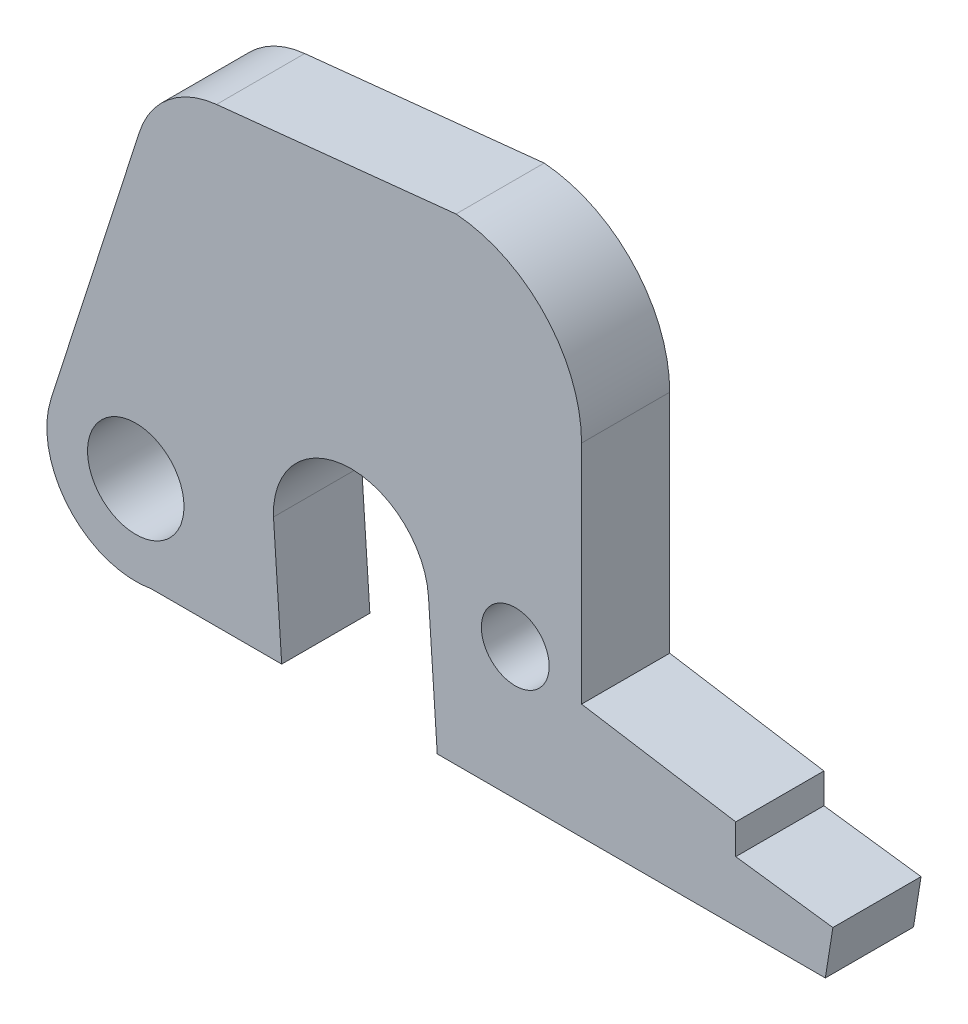
ISO-10303-21;
HEADER;
FILE_DESCRIPTION(('STEP AP214'),'2;1');
FILE_NAME('part.step','',(''),(''),'','','');
FILE_SCHEMA(('AUTOMOTIVE_DESIGN { 1 0 10303 214 1 1 1 1 }'));
ENDSEC;
DATA;
#1=APPLICATION_CONTEXT('core data for automotive mechanical design processes');
#2=APPLICATION_PROTOCOL_DEFINITION('international standard','automotive_design',2000,#1);
#3=PRODUCT_CONTEXT('',#1,'mechanical');
#4=PRODUCT('Part','Part','',(#3));
#5=PRODUCT_RELATED_PRODUCT_CATEGORY('part','',(#4));
#6=PRODUCT_DEFINITION_FORMATION('','',#4);
#7=PRODUCT_DEFINITION_CONTEXT('part definition',#1,'design');
#8=PRODUCT_DEFINITION('design','',#6,#7);
#9=PRODUCT_DEFINITION_SHAPE('','',#8);
#10=(LENGTH_UNIT() NAMED_UNIT(*) SI_UNIT(.MILLI.,.METRE.));
#11=(NAMED_UNIT(*) PLANE_ANGLE_UNIT() SI_UNIT($,.RADIAN.));
#12=(NAMED_UNIT(*) SI_UNIT($,.STERADIAN.) SOLID_ANGLE_UNIT());
#13=UNCERTAINTY_MEASURE_WITH_UNIT(LENGTH_MEASURE(1.E-05),#10,'distance_accuracy_value','');
#14=(GEOMETRIC_REPRESENTATION_CONTEXT(3) GLOBAL_UNCERTAINTY_ASSIGNED_CONTEXT((#13)) GLOBAL_UNIT_ASSIGNED_CONTEXT((#10,
#11,#12)) REPRESENTATION_CONTEXT('',''));
#15=CARTESIAN_POINT('',(0.,0.,0.));
#16=DIRECTION('',(0.,0.,1.));
#17=DIRECTION('',(1.,0.,0.));
#18=AXIS2_PLACEMENT_3D('',#15,#16,#17);
#19=CARTESIAN_POINT('',(-1.23620593143182,-5.65941247394212,1.4859));
#20=DIRECTION('',(0.,0.,1.));
#21=DIRECTION('',(1.,0.,0.));
#22=AXIS2_PLACEMENT_3D('',#19,#20,#21);
#23=PLANE('',#22);
#24=CARTESIAN_POINT('',(-8.49301630274746,-6.96993359020735,1.4859));
#25=DIRECTION('',(0.,0.,1.));
#26=DIRECTION('',(1.,0.,0.));
#27=AXIS2_PLACEMENT_3D('',#24,#25,#26);
#28=CIRCLE('',#27,1.6256);
#29=CARTESIAN_POINT('',(-6.86741630274746,-6.96993359020735,1.4859));
#30=VERTEX_POINT('',#29);
#31=EDGE_CURVE('E173',#30,#30,#28,.T.);
#32=ORIENTED_EDGE('',*,*,#31,.F.);
#33=EDGE_LOOP('',(#32));
#34=FACE_BOUND('',#33,.T.);
#35=DIRECTION('',(0.0664515565522178,-0.997789652497854,0.));
#36=VECTOR('',#35,1.);
#37=CARTESIAN_POINT('',(1.66958852630767,-9.92073691704316,1.4859));
#38=LINE('',#37,#36);
#39=CARTESIAN_POINT('',(1.37421135743306,-5.48556191169021,1.4859));
#40=VERTEX_POINT('',#39);
#41=CARTESIAN_POINT('',(1.66958852630767,-9.92073691704316,1.4859));
#42=VERTEX_POINT('',#41);
#43=EDGE_CURVE('E198',#40,#42,#38,.T.);
#44=ORIENTED_EDGE('',*,*,#43,.T.);
#45=DIRECTION('',(1.,0.,0.));
#46=VECTOR('',#45,1.);
#47=CARTESIAN_POINT('',(1.66958852630767,-9.92073691704316,1.4859));
#48=LINE('',#47,#46);
#49=CARTESIAN_POINT('',(14.7505885263077,-9.92073691704316,1.4859));
#50=VERTEX_POINT('',#49);
#51=EDGE_CURVE('E111',#42,#50,#48,.T.);
#52=ORIENTED_EDGE('',*,*,#51,.T.);
#53=DIRECTION('',(0.156767544200709,0.987635528464463,0.));
#54=VECTOR('',#53,1.);
#55=CARTESIAN_POINT('',(14.7505885263077,-9.92073691704316,1.4859));
#56=LINE('',#55,#54);
#57=CARTESIAN_POINT('',(15.0045885263077,-8.32053691704316,1.4859));
#58=VERTEX_POINT('',#57);
#59=EDGE_CURVE('E234',#50,#58,#56,.T.);
#60=ORIENTED_EDGE('',*,*,#59,.T.);
#61=DIRECTION('',(-0.99141388324305,0.130761279104084,0.));
#62=VECTOR('',#61,1.);
#63=CARTESIAN_POINT('',(15.0045885263077,-8.32053691704316,1.4859));
#64=LINE('',#63,#62);
#65=CARTESIAN_POINT('',(11.7307408114685,-7.88873691704316,1.4859));
#66=VERTEX_POINT('',#65);
#67=EDGE_CURVE('E253',#58,#66,#64,.T.);
#68=ORIENTED_EDGE('',*,*,#67,.T.);
#69=DIRECTION('',(0.,1.,0.));
#70=VECTOR('',#69,1.);
#71=CARTESIAN_POINT('',(11.7307408114685,-7.88873691704316,1.4859));
#72=LINE('',#71,#70);
#73=CARTESIAN_POINT('',(11.7307408114685,-6.87273691704316,1.4859));
#74=VERTEX_POINT('',#73);
#75=EDGE_CURVE('E250',#66,#74,#72,.T.);
#76=ORIENTED_EDGE('',*,*,#75,.T.);
#77=DIRECTION('',(-0.987241089858923,0.159232630117595,0.));
#78=VECTOR('',#77,1.);
#79=CARTESIAN_POINT('',(11.7307408114685,-6.87273691704316,1.4859));
#80=LINE('',#79,#78);
#81=CARTESIAN_POINT('',(6.53390721706875,-6.03453691704316,1.4859));
#82=VERTEX_POINT('',#81);
#83=EDGE_CURVE('E252',#74,#82,#80,.T.);
#84=ORIENTED_EDGE('',*,*,#83,.T.);
#85=DIRECTION('',(0.,1.,0.));
#86=VECTOR('',#85,1.);
#87=CARTESIAN_POINT('',(6.53390721706875,-6.03453691704316,1.4859));
#88=LINE('',#87,#86);
#89=CARTESIAN_POINT('',(6.53390721706875,1.58546308295684,1.4859));
#90=VERTEX_POINT('',#89);
#91=EDGE_CURVE('E255',#82,#90,#88,.T.);
#92=ORIENTED_EDGE('',*,*,#91,.T.);
#93=CARTESIAN_POINT('',(1.94827208508378,1.58546308295684,1.4859));
#94=DIRECTION('',(0.,0.,1.));
#95=DIRECTION('',(1.,0.,0.));
#96=AXIS2_PLACEMENT_3D('',#93,#94,#95);
#97=CIRCLE('',#96,4.58563513198498);
#98=CARTESIAN_POINT('',(2.30163530288507,6.15746308295684,1.4859));
#99=VERTEX_POINT('',#98);
#100=EDGE_CURVE('E261',#90,#99,#97,.T.);
#101=ORIENTED_EDGE('',*,*,#100,.T.);
#102=DIRECTION('',(-0.994652091225226,-0.103282222193776,0.));
#103=VECTOR('',#102,1.);
#104=CARTESIAN_POINT('',(2.30163530288507,6.15746308295684,1.4859));
#105=LINE('',#104,#103);
#106=CARTESIAN_POINT('',(-5.77059015040525,5.31926308295683,1.4859));
#107=VERTEX_POINT('',#106);
#108=EDGE_CURVE('E263',#99,#107,#105,.T.);
#109=ORIENTED_EDGE('',*,*,#108,.T.);
#110=CARTESIAN_POINT('',(-5.45413095411571,2.27162531247704,1.4859));
#111=DIRECTION('',(0.,0.,1.));
#112=DIRECTION('',(1.,0.,0.));
#113=AXIS2_PLACEMENT_3D('',#110,#111,#112);
#114=CIRCLE('',#113,3.06402389073115);
#115=CARTESIAN_POINT('',(-8.37133495275812,3.20872895310384,1.4859));
#116=VERTEX_POINT('',#115);
#117=EDGE_CURVE('E265',#107,#116,#114,.T.);
#118=ORIENTED_EDGE('',*,*,#117,.T.);
#119=DIRECTION('',(-0.305840840034436,-0.952082654272743,0.));
#120=VECTOR('',#119,1.);
#121=CARTESIAN_POINT('',(-8.37133495275813,3.20872895310384,1.4859));
#122=LINE('',#121,#120);
#123=CARTESIAN_POINT('',(-11.3465984341337,-6.05326742445613,1.4859));
#124=VERTEX_POINT('',#123);
#125=EDGE_CURVE('E267',#116,#124,#122,.T.);
#126=ORIENTED_EDGE('',*,*,#125,.T.);
#127=CARTESIAN_POINT('',(-8.49301630274746,-6.96993359020735,1.4859));
#128=DIRECTION('',(0.,0.,1.));
#129=DIRECTION('',(1.,0.,0.));
#130=AXIS2_PLACEMENT_3D('',#127,#128,#129);
#131=CIRCLE('',#130,2.9972);
#132=CARTESIAN_POINT('',(-7.96769015040525,-9.92073691704316,1.4859));
#133=VERTEX_POINT('',#132);
#134=EDGE_CURVE('E151',#124,#133,#131,.T.);
#135=ORIENTED_EDGE('',*,*,#134,.T.);
#136=DIRECTION('',(1.,0.,0.));
#137=VECTOR('',#136,1.);
#138=CARTESIAN_POINT('',(-7.96769015040524,-9.92073691704316,1.4859));
#139=LINE('',#138,#137);
#140=CARTESIAN_POINT('',(-3.57349015040525,-9.92073691704316,1.4859));
#141=VERTEX_POINT('',#140);
#142=EDGE_CURVE('E145',#133,#141,#139,.T.);
#143=ORIENTED_EDGE('',*,*,#142,.T.);
#144=DIRECTION('',(-0.0664515565522176,0.997789652497854,0.));
#145=VECTOR('',#144,1.);
#146=CARTESIAN_POINT('',(-3.85030075437916,-5.7643443405981,1.4859));
#147=LINE('',#146,#145);
#148=CARTESIAN_POINT('',(-3.85030075437916,-5.7643443405981,1.4859));
#149=VERTEX_POINT('',#148);
#150=EDGE_CURVE('E149',#141,#149,#147,.T.);
#151=ORIENTED_EDGE('',*,*,#150,.T.);
#152=CARTESIAN_POINT('',(-1.23620593143182,-5.65941247394212,1.4859));
#153=DIRECTION('',(0.,0.,-1.));
#154=DIRECTION('',(1.,0.,0.));
#155=AXIS2_PLACEMENT_3D('',#152,#153,#154);
#156=CIRCLE('',#155,2.6162);
#157=EDGE_CURVE('E47',#149,#40,#156,.T.);
#158=ORIENTED_EDGE('',*,*,#157,.T.);
#159=EDGE_LOOP('',(#44,#52,#60,#68,#76,#84,#92,#101,#109,#118,#126,#135,#143,#151,#158));
#160=FACE_BOUND('',#159,.T.);
#161=CARTESIAN_POINT('',(4.29870721706875,-5.47573691704316,1.4859));
#162=DIRECTION('',(0.,0.,1.));
#163=DIRECTION('',(1.,0.,0.));
#164=AXIS2_PLACEMENT_3D('',#161,#162,#163);
#165=CIRCLE('',#164,1.143);
#166=CARTESIAN_POINT('',(5.44170721706875,-5.47573691704316,1.4859));
#167=VERTEX_POINT('',#166);
#168=EDGE_CURVE('E310',#167,#167,#165,.T.);
#169=ORIENTED_EDGE('',*,*,#168,.F.);
#170=EDGE_LOOP('',(#169));
#171=FACE_BOUND('',#170,.T.);
#172=ADVANCED_FACE('F30',(#34,#160,#171),#23,.T.);
#173=CARTESIAN_POINT('',(-1.23620593143182,-5.65941247394212,-1.4859));
#174=DIRECTION('',(0.,0.,1.));
#175=DIRECTION('',(1.,0.,0.));
#176=AXIS2_PLACEMENT_3D('',#173,#174,#175);
#177=PLANE('',#176);
#178=CARTESIAN_POINT('',(-8.49301630274746,-6.96993359020735,-1.4859));
#179=DIRECTION('',(0.,0.,1.));
#180=DIRECTION('',(1.,0.,0.));
#181=AXIS2_PLACEMENT_3D('',#178,#179,#180);
#182=CIRCLE('',#181,1.6256);
#183=CARTESIAN_POINT('',(-6.86741630274746,-6.96993359020735,-1.4859));
#184=VERTEX_POINT('',#183);
#185=EDGE_CURVE('E315',#184,#184,#182,.T.);
#186=ORIENTED_EDGE('',*,*,#185,.T.);
#187=EDGE_LOOP('',(#186));
#188=FACE_BOUND('',#187,.T.);
#189=DIRECTION('',(0.0664515565522178,-0.997789652497854,0.));
#190=VECTOR('',#189,1.);
#191=CARTESIAN_POINT('',(1.66958852630767,-9.92073691704316,-1.4859));
#192=LINE('',#191,#190);
#193=CARTESIAN_POINT('',(1.37421135743306,-5.48556191169021,-1.4859));
#194=VERTEX_POINT('',#193);
#195=CARTESIAN_POINT('',(1.66958852630767,-9.92073691704316,-1.4859));
#196=VERTEX_POINT('',#195);
#197=EDGE_CURVE('E169',#194,#196,#192,.T.);
#198=ORIENTED_EDGE('',*,*,#197,.F.);
#199=CARTESIAN_POINT('',(-1.23620593143182,-5.65941247394212,-1.4859));
#200=DIRECTION('',(0.,0.,-1.));
#201=DIRECTION('',(1.,0.,0.));
#202=AXIS2_PLACEMENT_3D('',#199,#200,#201);
#203=CIRCLE('',#202,2.6162);
#204=CARTESIAN_POINT('',(-3.85030075437916,-5.7643443405981,-1.4859));
#205=VERTEX_POINT('',#204);
#206=EDGE_CURVE('E103',#205,#194,#203,.T.);
#207=ORIENTED_EDGE('',*,*,#206,.F.);
#208=DIRECTION('',(-0.0664515565522176,0.997789652497854,0.));
#209=VECTOR('',#208,1.);
#210=CARTESIAN_POINT('',(-3.85030075437916,-5.7643443405981,-1.4859));
#211=LINE('',#210,#209);
#212=CARTESIAN_POINT('',(-3.57349015040525,-9.92073691704316,-1.4859));
#213=VERTEX_POINT('',#212);
#214=EDGE_CURVE('E97',#213,#205,#211,.T.);
#215=ORIENTED_EDGE('',*,*,#214,.F.);
#216=DIRECTION('',(1.,0.,0.));
#217=VECTOR('',#216,1.);
#218=CARTESIAN_POINT('',(-7.96769015040524,-9.92073691704316,-1.4859));
#219=LINE('',#218,#217);
#220=CARTESIAN_POINT('',(-7.96769015040525,-9.92073691704316,-1.4859));
#221=VERTEX_POINT('',#220);
#222=EDGE_CURVE('E159',#221,#213,#219,.T.);
#223=ORIENTED_EDGE('',*,*,#222,.F.);
#224=CARTESIAN_POINT('',(-8.49301630274746,-6.96993359020735,-1.4859));
#225=DIRECTION('',(0.,0.,1.));
#226=DIRECTION('',(1.,0.,0.));
#227=AXIS2_PLACEMENT_3D('',#224,#225,#226);
#228=CIRCLE('',#227,2.9972);
#229=CARTESIAN_POINT('',(-11.3465984341337,-6.05326742445613,-1.4859));
#230=VERTEX_POINT('',#229);
#231=EDGE_CURVE('E193',#230,#221,#228,.T.);
#232=ORIENTED_EDGE('',*,*,#231,.F.);
#233=DIRECTION('',(-0.305840840034436,-0.952082654272743,0.));
#234=VECTOR('',#233,1.);
#235=CARTESIAN_POINT('',(-8.37133495275813,3.20872895310384,-1.4859));
#236=LINE('',#235,#234);
#237=CARTESIAN_POINT('',(-8.37133495275812,3.20872895310384,-1.4859));
#238=VERTEX_POINT('',#237);
#239=EDGE_CURVE('E191',#238,#230,#236,.T.);
#240=ORIENTED_EDGE('',*,*,#239,.F.);
#241=CARTESIAN_POINT('',(-5.45413095411571,2.27162531247704,-1.4859));
#242=DIRECTION('',(0.,0.,1.));
#243=DIRECTION('',(1.,0.,0.));
#244=AXIS2_PLACEMENT_3D('',#241,#242,#243);
#245=CIRCLE('',#244,3.06402389073115);
#246=CARTESIAN_POINT('',(-5.77059015040525,5.31926308295683,-1.4859));
#247=VERTEX_POINT('',#246);
#248=EDGE_CURVE('E189',#247,#238,#245,.T.);
#249=ORIENTED_EDGE('',*,*,#248,.F.);
#250=DIRECTION('',(-0.994652091225226,-0.103282222193776,0.));
#251=VECTOR('',#250,1.);
#252=CARTESIAN_POINT('',(2.30163530288507,6.15746308295684,-1.4859));
#253=LINE('',#252,#251);
#254=CARTESIAN_POINT('',(2.30163530288507,6.15746308295684,-1.4859));
#255=VERTEX_POINT('',#254);
#256=EDGE_CURVE('E187',#255,#247,#253,.T.);
#257=ORIENTED_EDGE('',*,*,#256,.F.);
#258=CARTESIAN_POINT('',(1.94827208508378,1.58546308295684,-1.4859));
#259=DIRECTION('',(0.,0.,1.));
#260=DIRECTION('',(1.,0.,0.));
#261=AXIS2_PLACEMENT_3D('',#258,#259,#260);
#262=CIRCLE('',#261,4.58563513198498);
#263=CARTESIAN_POINT('',(6.53390721706875,1.58546308295684,-1.4859));
#264=VERTEX_POINT('',#263);
#265=EDGE_CURVE('E185',#264,#255,#262,.T.);
#266=ORIENTED_EDGE('',*,*,#265,.F.);
#267=DIRECTION('',(0.,1.,0.));
#268=VECTOR('',#267,1.);
#269=CARTESIAN_POINT('',(6.53390721706875,-6.03453691704316,-1.4859));
#270=LINE('',#269,#268);
#271=CARTESIAN_POINT('',(6.53390721706875,-6.03453691704316,-1.4859));
#272=VERTEX_POINT('',#271);
#273=EDGE_CURVE('E183',#272,#264,#270,.T.);
#274=ORIENTED_EDGE('',*,*,#273,.F.);
#275=DIRECTION('',(-0.987241089858923,0.159232630117595,0.));
#276=VECTOR('',#275,1.);
#277=CARTESIAN_POINT('',(11.7307408114685,-6.87273691704316,-1.4859));
#278=LINE('',#277,#276);
#279=CARTESIAN_POINT('',(11.7307408114685,-6.87273691704316,-1.4859));
#280=VERTEX_POINT('',#279);
#281=EDGE_CURVE('E181',#280,#272,#278,.T.);
#282=ORIENTED_EDGE('',*,*,#281,.F.);
#283=DIRECTION('',(0.,1.,0.));
#284=VECTOR('',#283,1.);
#285=CARTESIAN_POINT('',(11.7307408114685,-7.88873691704316,-1.4859));
#286=LINE('',#285,#284);
#287=CARTESIAN_POINT('',(11.7307408114685,-7.88873691704316,-1.4859));
#288=VERTEX_POINT('',#287);
#289=EDGE_CURVE('E179',#288,#280,#286,.T.);
#290=ORIENTED_EDGE('',*,*,#289,.F.);
#291=DIRECTION('',(-0.99141388324305,0.130761279104084,0.));
#292=VECTOR('',#291,1.);
#293=CARTESIAN_POINT('',(15.0045885263077,-8.32053691704316,-1.4859));
#294=LINE('',#293,#292);
#295=CARTESIAN_POINT('',(15.0045885263077,-8.32053691704316,-1.4859));
#296=VERTEX_POINT('',#295);
#297=EDGE_CURVE('E177',#296,#288,#294,.T.);
#298=ORIENTED_EDGE('',*,*,#297,.F.);
#299=DIRECTION('',(0.156767544200709,0.987635528464463,0.));
#300=VECTOR('',#299,1.);
#301=CARTESIAN_POINT('',(14.7505885263077,-9.92073691704316,-1.4859));
#302=LINE('',#301,#300);
#303=CARTESIAN_POINT('',(14.7505885263077,-9.92073691704316,-1.4859));
#304=VERTEX_POINT('',#303);
#305=EDGE_CURVE('E175',#304,#296,#302,.T.);
#306=ORIENTED_EDGE('',*,*,#305,.F.);
#307=DIRECTION('',(1.,0.,0.));
#308=VECTOR('',#307,1.);
#309=CARTESIAN_POINT('',(1.66958852630767,-9.92073691704316,-1.4859));
#310=LINE('',#309,#308);
#311=EDGE_CURVE('E172',#196,#304,#310,.T.);
#312=ORIENTED_EDGE('',*,*,#311,.F.);
#313=EDGE_LOOP('',(#198,#207,#215,#223,#232,#240,#249,#257,#266,#274,#282,#290,#298,#306,#312));
#314=FACE_BOUND('',#313,.T.);
#315=CARTESIAN_POINT('',(4.29870721706875,-5.47573691704316,-1.4859));
#316=DIRECTION('',(0.,0.,1.));
#317=DIRECTION('',(1.,0.,0.));
#318=AXIS2_PLACEMENT_3D('',#315,#316,#317);
#319=CIRCLE('',#318,1.143);
#320=CARTESIAN_POINT('',(5.44170721706875,-5.47573691704316,-1.4859));
#321=VERTEX_POINT('',#320);
#322=EDGE_CURVE('E313',#321,#321,#319,.T.);
#323=ORIENTED_EDGE('',*,*,#322,.T.);
#324=EDGE_LOOP('',(#323));
#325=FACE_BOUND('',#324,.T.);
#326=ADVANCED_FACE('F238',(#188,#314,#325),#177,.F.);
#327=CARTESIAN_POINT('',(1.66958852630767,-9.92073691704316,1.4859));
#328=DIRECTION('',(0.997789652497854,0.0664515565522178,0.));
#329=DIRECTION('',(-0.0664515565522178,0.997789652497854,0.));
#330=AXIS2_PLACEMENT_3D('',#327,#328,#329);
#331=PLANE('',#330);
#332=ORIENTED_EDGE('',*,*,#197,.T.);
#333=DIRECTION('',(0.,0.,-1.));
#334=VECTOR('',#333,1.);
#335=CARTESIAN_POINT('',(1.66958852630767,-9.92073691704316,1.4859));
#336=LINE('',#335,#334);
#337=EDGE_CURVE('E11',#42,#196,#336,.T.);
#338=ORIENTED_EDGE('',*,*,#337,.F.);
#339=ORIENTED_EDGE('',*,*,#43,.F.);
#340=DIRECTION('',(0.,0.,-1.));
#341=VECTOR('',#340,1.);
#342=CARTESIAN_POINT('',(1.37421135743306,-5.48556191169021,1.4859));
#343=LINE('',#342,#341);
#344=EDGE_CURVE('E165',#40,#194,#343,.T.);
#345=ORIENTED_EDGE('',*,*,#344,.T.);
#346=EDGE_LOOP('',(#332,#338,#339,#345));
#347=FACE_BOUND('',#346,.T.);
#348=ADVANCED_FACE('F32',(#347),#331,.F.);
#349=CARTESIAN_POINT('',(1.66958852630767,-9.92073691704316,1.4859));
#350=DIRECTION('',(0.,1.,0.));
#351=DIRECTION('',(0.,0.,1.));
#352=AXIS2_PLACEMENT_3D('',#349,#350,#351);
#353=PLANE('',#352);
#354=ORIENTED_EDGE('',*,*,#311,.T.);
#355=DIRECTION('',(0.,0.,-1.));
#356=VECTOR('',#355,1.);
#357=CARTESIAN_POINT('',(14.7505885263077,-9.92073691704316,1.4859));
#358=LINE('',#357,#356);
#359=EDGE_CURVE('E39',#50,#304,#358,.T.);
#360=ORIENTED_EDGE('',*,*,#359,.F.);
#361=ORIENTED_EDGE('',*,*,#51,.F.);
#362=ORIENTED_EDGE('',*,*,#337,.T.);
#363=EDGE_LOOP('',(#354,#360,#361,#362));
#364=FACE_BOUND('',#363,.T.);
#365=ADVANCED_FACE('F438',(#364),#353,.F.);
#366=CARTESIAN_POINT('',(14.7505885263077,-9.92073691704316,1.4859));
#367=DIRECTION('',(-0.987635528464463,0.156767544200709,0.));
#368=DIRECTION('',(-0.156767544200709,-0.987635528464463,0.));
#369=AXIS2_PLACEMENT_3D('',#366,#367,#368);
#370=PLANE('',#369);
#371=ORIENTED_EDGE('',*,*,#305,.T.);
#372=DIRECTION('',(0.,0.,-1.));
#373=VECTOR('',#372,1.);
#374=CARTESIAN_POINT('',(15.0045885263077,-8.32053691704316,1.4859));
#375=LINE('',#374,#373);
#376=EDGE_CURVE('E226',#58,#296,#375,.T.);
#377=ORIENTED_EDGE('',*,*,#376,.F.);
#378=ORIENTED_EDGE('',*,*,#59,.F.);
#379=ORIENTED_EDGE('',*,*,#359,.T.);
#380=EDGE_LOOP('',(#371,#377,#378,#379));
#381=FACE_BOUND('',#380,.T.);
#382=ADVANCED_FACE('F232',(#381),#370,.F.);
#383=CARTESIAN_POINT('',(15.0045885263077,-8.32053691704316,1.4859));
#384=DIRECTION('',(-0.130761279104084,-0.99141388324305,0.));
#385=DIRECTION('',(0.99141388324305,-0.130761279104084,0.));
#386=AXIS2_PLACEMENT_3D('',#383,#384,#385);
#387=PLANE('',#386);
#388=ORIENTED_EDGE('',*,*,#297,.T.);
#389=DIRECTION('',(0.,0.,-1.));
#390=VECTOR('',#389,1.);
#391=CARTESIAN_POINT('',(11.7307408114685,-7.88873691704316,1.4859));
#392=LINE('',#391,#390);
#393=EDGE_CURVE('E223',#66,#288,#392,.T.);
#394=ORIENTED_EDGE('',*,*,#393,.F.);
#395=ORIENTED_EDGE('',*,*,#67,.F.);
#396=ORIENTED_EDGE('',*,*,#376,.T.);
#397=EDGE_LOOP('',(#388,#394,#395,#396));
#398=FACE_BOUND('',#397,.T.);
#399=ADVANCED_FACE('F244',(#398),#387,.F.);
#400=CARTESIAN_POINT('',(11.7307408114685,-7.88873691704316,1.4859));
#401=DIRECTION('',(-1.,0.,0.));
#402=DIRECTION('',(0.,-1.,0.));
#403=AXIS2_PLACEMENT_3D('',#400,#401,#402);
#404=PLANE('',#403);
#405=ORIENTED_EDGE('',*,*,#289,.T.);
#406=DIRECTION('',(0.,0.,-1.));
#407=VECTOR('',#406,1.);
#408=CARTESIAN_POINT('',(11.7307408114685,-6.87273691704316,1.4859));
#409=LINE('',#408,#407);
#410=EDGE_CURVE('E220',#74,#280,#409,.T.);
#411=ORIENTED_EDGE('',*,*,#410,.F.);
#412=ORIENTED_EDGE('',*,*,#75,.F.);
#413=ORIENTED_EDGE('',*,*,#393,.T.);
#414=EDGE_LOOP('',(#405,#411,#412,#413));
#415=FACE_BOUND('',#414,.T.);
#416=ADVANCED_FACE('F248',(#415),#404,.F.);
#417=CARTESIAN_POINT('',(11.7307408114685,-6.87273691704316,1.4859));
#418=DIRECTION('',(-0.159232630117595,-0.987241089858923,0.));
#419=DIRECTION('',(0.987241089858923,-0.159232630117595,0.));
#420=AXIS2_PLACEMENT_3D('',#417,#418,#419);
#421=PLANE('',#420);
#422=ORIENTED_EDGE('',*,*,#281,.T.);
#423=DIRECTION('',(0.,0.,-1.));
#424=VECTOR('',#423,1.);
#425=CARTESIAN_POINT('',(6.53390721706875,-6.03453691704316,1.4859));
#426=LINE('',#425,#424);
#427=EDGE_CURVE('E217',#82,#272,#426,.T.);
#428=ORIENTED_EDGE('',*,*,#427,.F.);
#429=ORIENTED_EDGE('',*,*,#83,.F.);
#430=ORIENTED_EDGE('',*,*,#410,.T.);
#431=EDGE_LOOP('',(#422,#428,#429,#430));
#432=FACE_BOUND('',#431,.T.);
#433=ADVANCED_FACE('F403',(#432),#421,.F.);
#434=CARTESIAN_POINT('',(6.53390721706875,-6.03453691704316,1.4859));
#435=DIRECTION('',(-1.,0.,0.));
#436=DIRECTION('',(0.,0.,1.));
#437=AXIS2_PLACEMENT_3D('',#434,#435,#436);
#438=PLANE('',#437);
#439=ORIENTED_EDGE('',*,*,#273,.T.);
#440=DIRECTION('',(0.,0.,-1.));
#441=VECTOR('',#440,1.);
#442=CARTESIAN_POINT('',(6.53390721706875,1.58546308295684,1.4859));
#443=LINE('',#442,#441);
#444=EDGE_CURVE('E214',#90,#264,#443,.T.);
#445=ORIENTED_EDGE('',*,*,#444,.F.);
#446=ORIENTED_EDGE('',*,*,#91,.F.);
#447=ORIENTED_EDGE('',*,*,#427,.T.);
#448=EDGE_LOOP('',(#439,#445,#446,#447));
#449=FACE_BOUND('',#448,.T.);
#450=ADVANCED_FACE('F393',(#449),#438,.F.);
#451=CARTESIAN_POINT('',(1.94827208508378,1.58546308295684,1.4859));
#452=DIRECTION('',(0.,0.,-1.));
#453=DIRECTION('',(-1.,0.,0.));
#454=AXIS2_PLACEMENT_3D('',#451,#452,#453);
#455=CYLINDRICAL_SURFACE('',#454,4.58563513198498);
#456=ORIENTED_EDGE('',*,*,#265,.T.);
#457=DIRECTION('',(0.,0.,-1.));
#458=VECTOR('',#457,1.);
#459=CARTESIAN_POINT('',(2.30163530288507,6.15746308295684,1.4859));
#460=LINE('',#459,#458);
#461=EDGE_CURVE('E211',#99,#255,#460,.T.);
#462=ORIENTED_EDGE('',*,*,#461,.F.);
#463=ORIENTED_EDGE('',*,*,#100,.F.);
#464=ORIENTED_EDGE('',*,*,#444,.T.);
#465=EDGE_LOOP('',(#456,#462,#463,#464));
#466=FACE_BOUND('',#465,.T.);
#467=ADVANCED_FACE('F383',(#466),#455,.T.);
#468=CARTESIAN_POINT('',(2.30163530288507,6.15746308295684,1.4859));
#469=DIRECTION('',(0.103282222193776,-0.994652091225226,0.));
#470=DIRECTION('',(0.994652091225226,0.103282222193776,0.));
#471=AXIS2_PLACEMENT_3D('',#468,#469,#470);
#472=PLANE('',#471);
#473=ORIENTED_EDGE('',*,*,#256,.T.);
#474=DIRECTION('',(0.,0.,-1.));
#475=VECTOR('',#474,1.);
#476=CARTESIAN_POINT('',(-5.77059015040525,5.31926308295683,1.4859));
#477=LINE('',#476,#475);
#478=EDGE_CURVE('E208',#107,#247,#477,.T.);
#479=ORIENTED_EDGE('',*,*,#478,.F.);
#480=ORIENTED_EDGE('',*,*,#108,.F.);
#481=ORIENTED_EDGE('',*,*,#461,.T.);
#482=EDGE_LOOP('',(#473,#479,#480,#481));
#483=FACE_BOUND('',#482,.T.);
#484=ADVANCED_FACE('F373',(#483),#472,.F.);
#485=CARTESIAN_POINT('',(-5.45413095411571,2.27162531247704,1.4859));
#486=DIRECTION('',(0.,0.,-1.));
#487=DIRECTION('',(-1.,0.,0.));
#488=AXIS2_PLACEMENT_3D('',#485,#486,#487);
#489=CYLINDRICAL_SURFACE('',#488,3.06402389073115);
#490=ORIENTED_EDGE('',*,*,#248,.T.);
#491=DIRECTION('',(0.,0.,-1.));
#492=VECTOR('',#491,1.);
#493=CARTESIAN_POINT('',(-8.37133495275812,3.20872895310384,1.4859));
#494=LINE('',#493,#492);
#495=EDGE_CURVE('E205',#116,#238,#494,.T.);
#496=ORIENTED_EDGE('',*,*,#495,.F.);
#497=ORIENTED_EDGE('',*,*,#117,.F.);
#498=ORIENTED_EDGE('',*,*,#478,.T.);
#499=EDGE_LOOP('',(#490,#496,#497,#498));
#500=FACE_BOUND('',#499,.T.);
#501=ADVANCED_FACE('F364',(#500),#489,.T.);
#502=CARTESIAN_POINT('',(-8.37133495275813,3.20872895310384,1.4859));
#503=DIRECTION('',(0.952082654272743,-0.305840840034436,0.));
#504=DIRECTION('',(0.305840840034436,0.952082654272743,0.));
#505=AXIS2_PLACEMENT_3D('',#502,#503,#504);
#506=PLANE('',#505);
#507=ORIENTED_EDGE('',*,*,#239,.T.);
#508=DIRECTION('',(0.,0.,-1.));
#509=VECTOR('',#508,1.);
#510=CARTESIAN_POINT('',(-11.3465984341337,-6.05326742445613,1.4859));
#511=LINE('',#510,#509);
#512=EDGE_CURVE('E202',#124,#230,#511,.T.);
#513=ORIENTED_EDGE('',*,*,#512,.F.);
#514=ORIENTED_EDGE('',*,*,#125,.F.);
#515=ORIENTED_EDGE('',*,*,#495,.T.);
#516=EDGE_LOOP('',(#507,#513,#514,#515));
#517=FACE_BOUND('',#516,.T.);
#518=ADVANCED_FACE('F273',(#517),#506,.F.);
#519=CARTESIAN_POINT('',(-8.49301630274746,-6.96993359020735,1.4859));
#520=DIRECTION('',(0.,0.,-1.));
#521=DIRECTION('',(-1.,0.,0.));
#522=AXIS2_PLACEMENT_3D('',#519,#520,#521);
#523=CYLINDRICAL_SURFACE('',#522,2.9972);
#524=ORIENTED_EDGE('',*,*,#231,.T.);
#525=DIRECTION('',(0.,0.,-1.));
#526=VECTOR('',#525,1.);
#527=CARTESIAN_POINT('',(-7.96769015040525,-9.92073691704316,1.4859));
#528=LINE('',#527,#526);
#529=EDGE_CURVE('E160',#133,#221,#528,.T.);
#530=ORIENTED_EDGE('',*,*,#529,.F.);
#531=ORIENTED_EDGE('',*,*,#134,.F.);
#532=ORIENTED_EDGE('',*,*,#512,.T.);
#533=EDGE_LOOP('',(#524,#530,#531,#532));
#534=FACE_BOUND('',#533,.T.);
#535=ADVANCED_FACE('F277',(#534),#523,.T.);
#536=CARTESIAN_POINT('',(-7.96769015040524,-9.92073691704316,1.4859));
#537=DIRECTION('',(0.,1.,0.));
#538=DIRECTION('',(-1.,0.,0.));
#539=AXIS2_PLACEMENT_3D('',#536,#537,#538);
#540=PLANE('',#539);
#541=ORIENTED_EDGE('',*,*,#222,.T.);
#542=DIRECTION('',(0.,0.,-1.));
#543=VECTOR('',#542,1.);
#544=CARTESIAN_POINT('',(-3.57349015040525,-9.92073691704316,1.4859));
#545=LINE('',#544,#543);
#546=EDGE_CURVE('E156',#141,#213,#545,.T.);
#547=ORIENTED_EDGE('',*,*,#546,.F.);
#548=ORIENTED_EDGE('',*,*,#142,.F.);
#549=ORIENTED_EDGE('',*,*,#529,.T.);
#550=EDGE_LOOP('',(#541,#547,#548,#549));
#551=FACE_BOUND('',#550,.T.);
#552=ADVANCED_FACE('F157',(#551),#540,.F.);
#553=CARTESIAN_POINT('',(-3.85030075437916,-5.7643443405981,1.4859));
#554=DIRECTION('',(-0.997789652497854,-0.0664515565522176,0.));
#555=DIRECTION('',(0.0664515565522176,-0.997789652497854,0.));
#556=AXIS2_PLACEMENT_3D('',#553,#554,#555);
#557=PLANE('',#556);
#558=ORIENTED_EDGE('',*,*,#214,.T.);
#559=DIRECTION('',(0.,0.,-1.));
#560=VECTOR('',#559,1.);
#561=CARTESIAN_POINT('',(-3.85030075437916,-5.7643443405981,1.4859));
#562=LINE('',#561,#560);
#563=EDGE_CURVE('E161',#149,#205,#562,.T.);
#564=ORIENTED_EDGE('',*,*,#563,.F.);
#565=ORIENTED_EDGE('',*,*,#150,.F.);
#566=ORIENTED_EDGE('',*,*,#546,.T.);
#567=EDGE_LOOP('',(#558,#564,#565,#566));
#568=FACE_BOUND('',#567,.T.);
#569=ADVANCED_FACE('F163',(#568),#557,.F.);
#570=CARTESIAN_POINT('',(-1.23620593143182,-5.65941247394212,1.4859));
#571=DIRECTION('',(0.,0.,-1.));
#572=DIRECTION('',(-1.,0.,0.));
#573=AXIS2_PLACEMENT_3D('',#570,#571,#572);
#574=CYLINDRICAL_SURFACE('',#573,2.6162);
#575=ORIENTED_EDGE('',*,*,#206,.T.);
#576=ORIENTED_EDGE('',*,*,#344,.F.);
#577=ORIENTED_EDGE('',*,*,#157,.F.);
#578=ORIENTED_EDGE('',*,*,#563,.T.);
#579=EDGE_LOOP('',(#575,#576,#577,#578));
#580=FACE_BOUND('',#579,.T.);
#581=ADVANCED_FACE('F281',(#580),#574,.F.);
#582=CARTESIAN_POINT('',(-8.49301630274746,-6.96993359020735,1.4859));
#583=DIRECTION('',(0.,0.,-1.));
#584=DIRECTION('',(-1.,0.,0.));
#585=AXIS2_PLACEMENT_3D('',#582,#583,#584);
#586=CYLINDRICAL_SURFACE('',#585,1.6256);
#587=ORIENTED_EDGE('',*,*,#31,.T.);
#588=EDGE_LOOP('',(#587));
#589=FACE_BOUND('',#588,.T.);
#590=ORIENTED_EDGE('',*,*,#185,.F.);
#591=EDGE_LOOP('',(#590));
#592=FACE_BOUND('',#591,.T.);
#593=ADVANCED_FACE('F283',(#589,#592),#586,.F.);
#594=CARTESIAN_POINT('',(4.29870721706875,-5.47573691704316,1.4859));
#595=DIRECTION('',(0.,0.,-1.));
#596=DIRECTION('',(-1.,0.,0.));
#597=AXIS2_PLACEMENT_3D('',#594,#595,#596);
#598=CYLINDRICAL_SURFACE('',#597,1.143);
#599=ORIENTED_EDGE('',*,*,#168,.T.);
#600=EDGE_LOOP('',(#599));
#601=FACE_BOUND('',#600,.T.);
#602=ORIENTED_EDGE('',*,*,#322,.F.);
#603=EDGE_LOOP('',(#602));
#604=FACE_BOUND('',#603,.T.);
#605=ADVANCED_FACE('F289',(#601,#604),#598,.F.);
#606=CLOSED_SHELL('',(#172,#326,#348,#365,#382,#399,#416,#433,#450,#467,#484,#501,#518,#535,
#552,#569,#581,#593,#605));
#607=MANIFOLD_SOLID_BREP('B2',#606);
#608=ADVANCED_BREP_SHAPE_REPRESENTATION('',(#18,#607),#14);
#609=SHAPE_DEFINITION_REPRESENTATION(#9,#608);
ENDSEC;
END-ISO-10303-21;
